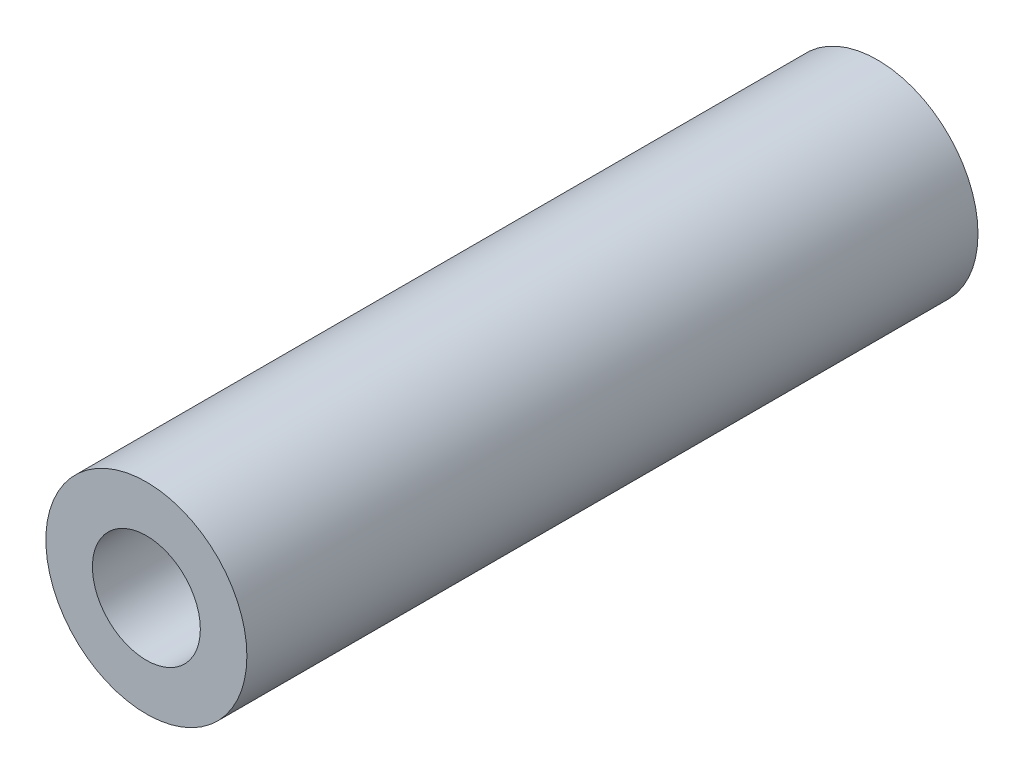
ISO-10303-21;
HEADER;
FILE_DESCRIPTION(('STEP AP214'),'2;1');
FILE_NAME('part.step','',(''),(''),'','','');
FILE_SCHEMA(('AUTOMOTIVE_DESIGN { 1 0 10303 214 1 1 1 1 }'));
ENDSEC;
DATA;
#1=APPLICATION_CONTEXT('core data for automotive mechanical design processes');
#2=APPLICATION_PROTOCOL_DEFINITION('international standard','automotive_design',2000,#1);
#3=PRODUCT_CONTEXT('',#1,'mechanical');
#4=PRODUCT('Part','Part','',(#3));
#5=PRODUCT_RELATED_PRODUCT_CATEGORY('part','',(#4));
#6=PRODUCT_DEFINITION_FORMATION('','',#4);
#7=PRODUCT_DEFINITION_CONTEXT('part definition',#1,'design');
#8=PRODUCT_DEFINITION('design','',#6,#7);
#9=PRODUCT_DEFINITION_SHAPE('','',#8);
#10=(LENGTH_UNIT() NAMED_UNIT(*) SI_UNIT(.MILLI.,.METRE.));
#11=(NAMED_UNIT(*) PLANE_ANGLE_UNIT() SI_UNIT($,.RADIAN.));
#12=(NAMED_UNIT(*) SI_UNIT($,.STERADIAN.) SOLID_ANGLE_UNIT());
#13=UNCERTAINTY_MEASURE_WITH_UNIT(LENGTH_MEASURE(1.E-05),#10,'distance_accuracy_value','');
#14=(GEOMETRIC_REPRESENTATION_CONTEXT(3) GLOBAL_UNCERTAINTY_ASSIGNED_CONTEXT((#13)) GLOBAL_UNIT_ASSIGNED_CONTEXT((#10,
#11,#12)) REPRESENTATION_CONTEXT('',''));
#15=CARTESIAN_POINT('',(0.,0.,0.));
#16=DIRECTION('',(0.,0.,1.));
#17=DIRECTION('',(1.,0.,0.));
#18=AXIS2_PLACEMENT_3D('',#15,#16,#17);
#19=CARTESIAN_POINT('',(0.,0.,20.32));
#20=DIRECTION('',(0.,0.,1.));
#21=DIRECTION('',(1.,0.,0.));
#22=AXIS2_PLACEMENT_3D('',#19,#20,#21);
#23=PLANE('',#22);
#24=CARTESIAN_POINT('',(0.,0.,20.32));
#25=DIRECTION('',(0.,0.,1.));
#26=DIRECTION('',(1.,0.,0.));
#27=AXIS2_PLACEMENT_3D('',#24,#25,#26);
#28=CIRCLE('',#27,2.794);
#29=CARTESIAN_POINT('',(2.794,0.,20.32));
#30=VERTEX_POINT('',#29);
#31=EDGE_CURVE('E10',#30,#30,#28,.T.);
#32=ORIENTED_EDGE('',*,*,#31,.T.);
#33=EDGE_LOOP('',(#32));
#34=FACE_BOUND('',#33,.T.);
#35=CARTESIAN_POINT('',(0.,0.,20.32));
#36=DIRECTION('',(0.,0.,1.));
#37=DIRECTION('',(1.,0.,0.));
#38=AXIS2_PLACEMENT_3D('',#35,#36,#37);
#39=CIRCLE('',#38,1.5);
#40=CARTESIAN_POINT('',(1.5,0.,20.32));
#41=VERTEX_POINT('',#40);
#42=EDGE_CURVE('E42',#41,#41,#39,.T.);
#43=ORIENTED_EDGE('',*,*,#42,.F.);
#44=EDGE_LOOP('',(#43));
#45=FACE_BOUND('',#44,.T.);
#46=ADVANCED_FACE('F31',(#34,#45),#23,.T.);
#47=CARTESIAN_POINT('',(0.,0.,0.));
#48=DIRECTION('',(0.,0.,1.));
#49=DIRECTION('',(1.,0.,0.));
#50=AXIS2_PLACEMENT_3D('',#47,#48,#49);
#51=PLANE('',#50);
#52=CARTESIAN_POINT('',(0.,0.,0.));
#53=DIRECTION('',(0.,0.,1.));
#54=DIRECTION('',(1.,0.,0.));
#55=AXIS2_PLACEMENT_3D('',#52,#53,#54);
#56=CIRCLE('',#55,2.794);
#57=CARTESIAN_POINT('',(2.794,0.,0.));
#58=VERTEX_POINT('',#57);
#59=EDGE_CURVE('E35',#58,#58,#56,.T.);
#60=ORIENTED_EDGE('',*,*,#59,.F.);
#61=EDGE_LOOP('',(#60));
#62=FACE_BOUND('',#61,.T.);
#63=CARTESIAN_POINT('',(0.,0.,0.));
#64=DIRECTION('',(0.,0.,1.));
#65=DIRECTION('',(1.,0.,0.));
#66=AXIS2_PLACEMENT_3D('',#63,#64,#65);
#67=CIRCLE('',#66,1.5);
#68=CARTESIAN_POINT('',(1.5,0.,0.));
#69=VERTEX_POINT('',#68);
#70=EDGE_CURVE('E44',#69,#69,#67,.T.);
#71=ORIENTED_EDGE('',*,*,#70,.T.);
#72=EDGE_LOOP('',(#71));
#73=FACE_BOUND('',#72,.T.);
#74=ADVANCED_FACE('F54',(#62,#73),#51,.F.);
#75=CARTESIAN_POINT('',(0.,0.,20.32));
#76=DIRECTION('',(0.,0.,-1.));
#77=DIRECTION('',(-1.,0.,0.));
#78=AXIS2_PLACEMENT_3D('',#75,#76,#77);
#79=CYLINDRICAL_SURFACE('',#78,2.794);
#80=ORIENTED_EDGE('',*,*,#31,.F.);
#81=EDGE_LOOP('',(#80));
#82=FACE_BOUND('',#81,.T.);
#83=ORIENTED_EDGE('',*,*,#59,.T.);
#84=EDGE_LOOP('',(#83));
#85=FACE_BOUND('',#84,.T.);
#86=ADVANCED_FACE('F33',(#82,#85),#79,.T.);
#87=CARTESIAN_POINT('',(0.,0.,20.32));
#88=DIRECTION('',(0.,0.,-1.));
#89=DIRECTION('',(-1.,0.,0.));
#90=AXIS2_PLACEMENT_3D('',#87,#88,#89);
#91=CYLINDRICAL_SURFACE('',#90,1.5);
#92=ORIENTED_EDGE('',*,*,#42,.T.);
#93=EDGE_LOOP('',(#92));
#94=FACE_BOUND('',#93,.T.);
#95=ORIENTED_EDGE('',*,*,#70,.F.);
#96=EDGE_LOOP('',(#95));
#97=FACE_BOUND('',#96,.T.);
#98=ADVANCED_FACE('F50',(#94,#97),#91,.F.);
#99=CLOSED_SHELL('',(#46,#74,#86,#98));
#100=MANIFOLD_SOLID_BREP('B2',#99);
#101=ADVANCED_BREP_SHAPE_REPRESENTATION('',(#18,#100),#14);
#102=SHAPE_DEFINITION_REPRESENTATION(#9,#101);
ENDSEC;
END-ISO-10303-21;
